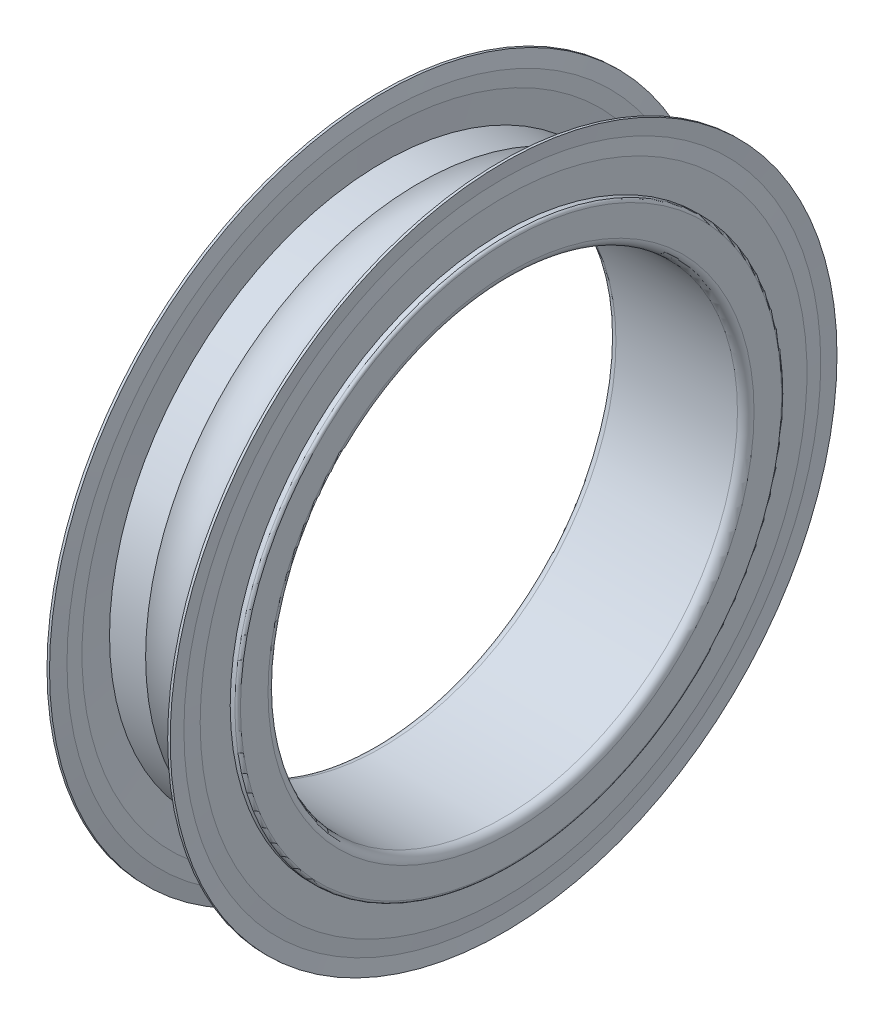
ISO-10303-21;
HEADER;
FILE_DESCRIPTION(('STEP AP214'),'2;1');
FILE_NAME('part.step','',(''),(''),'','','');
FILE_SCHEMA(('AUTOMOTIVE_DESIGN { 1 0 10303 214 1 1 1 1 }'));
ENDSEC;
DATA;
#1=APPLICATION_CONTEXT('core data for automotive mechanical design processes');
#2=APPLICATION_PROTOCOL_DEFINITION('international standard','automotive_design',2000,#1);
#3=PRODUCT_CONTEXT('',#1,'mechanical');
#4=PRODUCT('Part','Part','',(#3));
#5=PRODUCT_RELATED_PRODUCT_CATEGORY('part','',(#4));
#6=PRODUCT_DEFINITION_FORMATION('','',#4);
#7=PRODUCT_DEFINITION_CONTEXT('part definition',#1,'design');
#8=PRODUCT_DEFINITION('design','',#6,#7);
#9=PRODUCT_DEFINITION_SHAPE('','',#8);
#10=(LENGTH_UNIT() NAMED_UNIT(*) SI_UNIT(.MILLI.,.METRE.));
#11=(NAMED_UNIT(*) PLANE_ANGLE_UNIT() SI_UNIT($,.RADIAN.));
#12=(NAMED_UNIT(*) SI_UNIT($,.STERADIAN.) SOLID_ANGLE_UNIT());
#13=UNCERTAINTY_MEASURE_WITH_UNIT(LENGTH_MEASURE(1.E-05),#10,'distance_accuracy_value','');
#14=(GEOMETRIC_REPRESENTATION_CONTEXT(3) GLOBAL_UNCERTAINTY_ASSIGNED_CONTEXT((#13)) GLOBAL_UNIT_ASSIGNED_CONTEXT((#10,
#11,#12)) REPRESENTATION_CONTEXT('',''));
#15=CARTESIAN_POINT('',(0.,0.,0.));
#16=DIRECTION('',(0.,0.,1.));
#17=DIRECTION('',(1.,0.,0.));
#18=AXIS2_PLACEMENT_3D('',#15,#16,#17);
#19=CARTESIAN_POINT('',(2.5,0.,0.));
#20=DIRECTION('',(1.,0.,0.));
#21=DIRECTION('',(0.,0.,-1.));
#22=AXIS2_PLACEMENT_3D('',#19,#20,#21);
#23=TOROIDAL_SURFACE('',#22,10.75,1.1905);
#24=CARTESIAN_POINT('',(1.66645920915651,0.,0.));
#25=DIRECTION('',(-1.,0.,0.));
#26=DIRECTION('',(0.,0.,1.));
#27=AXIS2_PLACEMENT_3D('',#24,#25,#26);
#28=CIRCLE('',#27,9.9);
#29=CARTESIAN_POINT('',(1.66645920915651,0.,9.9));
#30=VERTEX_POINT('',#29);
#31=EDGE_CURVE('E190',#30,#30,#28,.T.);
#32=ORIENTED_EDGE('',*,*,#31,.F.);
#33=EDGE_LOOP('',(#32));
#34=FACE_BOUND('',#33,.T.);
#35=CARTESIAN_POINT('',(3.3335407908435,0.,0.));
#36=DIRECTION('',(-1.,0.,0.));
#37=DIRECTION('',(0.,0.,1.));
#38=AXIS2_PLACEMENT_3D('',#35,#36,#37);
#39=CIRCLE('',#38,9.9);
#40=CARTESIAN_POINT('',(3.3335407908435,0.,9.9));
#41=VERTEX_POINT('',#40);
#42=EDGE_CURVE('E195',#41,#41,#39,.F.);
#43=ORIENTED_EDGE('',*,*,#42,.F.);
#44=EDGE_LOOP('',(#43));
#45=FACE_BOUND('',#44,.T.);
#46=ADVANCED_FACE('F15',(#34,#45),#23,.F.);
#47=CARTESIAN_POINT('',(50.,0.,0.));
#48=DIRECTION('',(-1.,0.,0.));
#49=DIRECTION('',(0.,0.,1.));
#50=AXIS2_PLACEMENT_3D('',#47,#48,#49);
#51=CYLINDRICAL_SURFACE('',#50,9.9);
#52=CARTESIAN_POINT('',(4.64,0.,0.));
#53=DIRECTION('',(-1.,0.,0.));
#54=DIRECTION('',(0.,0.,1.));
#55=AXIS2_PLACEMENT_3D('',#52,#53,#54);
#56=CIRCLE('',#55,9.9);
#57=CARTESIAN_POINT('',(4.64,0.,9.9));
#58=VERTEX_POINT('',#57);
#59=EDGE_CURVE('E185',#58,#58,#56,.T.);
#60=ORIENTED_EDGE('',*,*,#59,.T.);
#61=EDGE_LOOP('',(#60));
#62=FACE_BOUND('',#61,.T.);
#63=ORIENTED_EDGE('',*,*,#42,.T.);
#64=EDGE_LOOP('',(#63));
#65=FACE_BOUND('',#64,.T.);
#66=ADVANCED_FACE('F235',(#62,#65),#51,.T.);
#67=CARTESIAN_POINT('',(50.,0.,0.));
#68=DIRECTION('',(-1.,0.,0.));
#69=DIRECTION('',(0.,0.,1.));
#70=AXIS2_PLACEMENT_3D('',#67,#68,#69);
#71=CYLINDRICAL_SURFACE('',#70,9.9);
#72=ORIENTED_EDGE('',*,*,#31,.T.);
#73=EDGE_LOOP('',(#72));
#74=FACE_BOUND('',#73,.T.);
#75=CARTESIAN_POINT('',(0.359999999999999,0.,0.));
#76=DIRECTION('',(1.,0.,0.));
#77=DIRECTION('',(0.,0.,-1.));
#78=AXIS2_PLACEMENT_3D('',#75,#76,#77);
#79=CIRCLE('',#78,9.9);
#80=CARTESIAN_POINT('',(0.359999999999999,0.,-9.9));
#81=VERTEX_POINT('',#80);
#82=EDGE_CURVE('E182',#81,#81,#79,.T.);
#83=ORIENTED_EDGE('',*,*,#82,.T.);
#84=EDGE_LOOP('',(#83));
#85=FACE_BOUND('',#84,.T.);
#86=ADVANCED_FACE('F231',(#74,#85),#71,.T.);
#87=CARTESIAN_POINT('',(4.55,0.,0.));
#88=DIRECTION('',(-1.,0.,0.));
#89=DIRECTION('',(0.,0.,1.));
#90=AXIS2_PLACEMENT_3D('',#87,#88,#89);
#91=CONICAL_SURFACE('',#90,10.9875,1.48822587110018);
#92=CARTESIAN_POINT('',(4.55,0.,0.));
#93=DIRECTION('',(-1.,0.,0.));
#94=DIRECTION('',(0.,0.,1.));
#95=AXIS2_PLACEMENT_3D('',#92,#93,#94);
#96=CIRCLE('',#95,10.9875);
#97=CARTESIAN_POINT('',(4.55,0.,10.9875));
#98=VERTEX_POINT('',#97);
#99=EDGE_CURVE('E19',#98,#98,#96,.F.);
#100=ORIENTED_EDGE('',*,*,#99,.F.);
#101=EDGE_LOOP('',(#100));
#102=FACE_BOUND('',#101,.T.);
#103=ORIENTED_EDGE('',*,*,#59,.F.);
#104=EDGE_LOOP('',(#103));
#105=FACE_BOUND('',#104,.T.);
#106=ADVANCED_FACE('F227',(#102,#105),#91,.F.);
#107=CARTESIAN_POINT('',(0.449999999999999,0.,0.));
#108=DIRECTION('',(1.,0.,0.));
#109=DIRECTION('',(0.,0.,-1.));
#110=AXIS2_PLACEMENT_3D('',#107,#108,#109);
#111=CONICAL_SURFACE('',#110,10.9875,1.48822587110018);
#112=ORIENTED_EDGE('',*,*,#82,.F.);
#113=EDGE_LOOP('',(#112));
#114=FACE_BOUND('',#113,.T.);
#115=CARTESIAN_POINT('',(0.449999999999999,0.,0.));
#116=DIRECTION('',(1.,0.,0.));
#117=DIRECTION('',(0.,0.,-1.));
#118=AXIS2_PLACEMENT_3D('',#115,#116,#117);
#119=CIRCLE('',#118,10.9875);
#120=CARTESIAN_POINT('',(0.449999999999999,0.,-10.9875));
#121=VERTEX_POINT('',#120);
#122=EDGE_CURVE('E218',#121,#121,#119,.F.);
#123=ORIENTED_EDGE('',*,*,#122,.F.);
#124=EDGE_LOOP('',(#123));
#125=FACE_BOUND('',#124,.T.);
#126=ADVANCED_FACE('F230',(#114,#125),#111,.F.);
#127=CARTESIAN_POINT('',(4.55,11.53125,0.));
#128=DIRECTION('',(-1.,0.,0.));
#129=DIRECTION('',(0.,0.,1.));
#130=AXIS2_PLACEMENT_3D('',#127,#128,#129);
#131=PLANE('',#130);
#132=CARTESIAN_POINT('',(4.55,0.,0.));
#133=DIRECTION('',(1.,0.,0.));
#134=DIRECTION('',(0.,0.,-1.));
#135=AXIS2_PLACEMENT_3D('',#132,#133,#134);
#136=CIRCLE('',#135,11.53125);
#137=CARTESIAN_POINT('',(4.55,0.,-11.53125));
#138=VERTEX_POINT('',#137);
#139=EDGE_CURVE('E216',#138,#138,#136,.T.);
#140=ORIENTED_EDGE('',*,*,#139,.F.);
#141=EDGE_LOOP('',(#140));
#142=FACE_BOUND('',#141,.T.);
#143=ORIENTED_EDGE('',*,*,#99,.T.);
#144=EDGE_LOOP('',(#143));
#145=FACE_BOUND('',#144,.T.);
#146=ADVANCED_FACE('F225',(#142,#145),#131,.T.);
#147=CARTESIAN_POINT('',(0.45,10.9875,0.));
#148=DIRECTION('',(1.,0.,0.));
#149=DIRECTION('',(0.,0.,-1.));
#150=AXIS2_PLACEMENT_3D('',#147,#148,#149);
#151=PLANE('',#150);
#152=ORIENTED_EDGE('',*,*,#122,.T.);
#153=EDGE_LOOP('',(#152));
#154=FACE_BOUND('',#153,.T.);
#155=CARTESIAN_POINT('',(0.449999999999999,0.,0.));
#156=DIRECTION('',(-1.,0.,0.));
#157=DIRECTION('',(0.,0.,1.));
#158=AXIS2_PLACEMENT_3D('',#155,#156,#157);
#159=CIRCLE('',#158,11.53125);
#160=CARTESIAN_POINT('',(0.449999999999999,0.,11.53125));
#161=VERTEX_POINT('',#160);
#162=EDGE_CURVE('E179',#161,#161,#159,.T.);
#163=ORIENTED_EDGE('',*,*,#162,.F.);
#164=EDGE_LOOP('',(#163));
#165=FACE_BOUND('',#164,.T.);
#166=ADVANCED_FACE('F386',(#154,#165),#151,.T.);
#167=CARTESIAN_POINT('',(4.64,0.,0.));
#168=DIRECTION('',(1.,0.,0.));
#169=DIRECTION('',(0.,0.,-1.));
#170=AXIS2_PLACEMENT_3D('',#167,#168,#169);
#171=CONICAL_SURFACE('',#170,12.075,1.40676621714642);
#172=CARTESIAN_POINT('',(4.64,0.,0.));
#173=DIRECTION('',(-1.,0.,0.));
#174=DIRECTION('',(0.,0.,1.));
#175=AXIS2_PLACEMENT_3D('',#172,#173,#174);
#176=CIRCLE('',#175,12.075);
#177=CARTESIAN_POINT('',(4.64,0.,12.075));
#178=VERTEX_POINT('',#177);
#179=EDGE_CURVE('E174',#178,#178,#176,.F.);
#180=ORIENTED_EDGE('',*,*,#179,.F.);
#181=EDGE_LOOP('',(#180));
#182=FACE_BOUND('',#181,.T.);
#183=ORIENTED_EDGE('',*,*,#139,.T.);
#184=EDGE_LOOP('',(#183));
#185=FACE_BOUND('',#184,.T.);
#186=ADVANCED_FACE('F378',(#182,#185),#171,.T.);
#187=CARTESIAN_POINT('',(0.360000000000001,0.,0.));
#188=DIRECTION('',(-1.,0.,0.));
#189=DIRECTION('',(0.,0.,1.));
#190=AXIS2_PLACEMENT_3D('',#187,#188,#189);
#191=CONICAL_SURFACE('',#190,12.075,1.40676621714642);
#192=ORIENTED_EDGE('',*,*,#162,.T.);
#193=EDGE_LOOP('',(#192));
#194=FACE_BOUND('',#193,.T.);
#195=CARTESIAN_POINT('',(0.359999999999999,0.,0.));
#196=DIRECTION('',(-1.,0.,0.));
#197=DIRECTION('',(0.,0.,1.));
#198=AXIS2_PLACEMENT_3D('',#195,#196,#197);
#199=CIRCLE('',#198,12.075);
#200=CARTESIAN_POINT('',(0.359999999999999,0.,12.075));
#201=VERTEX_POINT('',#200);
#202=EDGE_CURVE('E169',#201,#201,#199,.T.);
#203=ORIENTED_EDGE('',*,*,#202,.F.);
#204=EDGE_LOOP('',(#203));
#205=FACE_BOUND('',#204,.T.);
#206=ADVANCED_FACE('F370',(#194,#205),#191,.T.);
#207=CARTESIAN_POINT('',(50.,0.,0.));
#208=DIRECTION('',(-1.,0.,0.));
#209=DIRECTION('',(0.,0.,1.));
#210=AXIS2_PLACEMENT_3D('',#207,#208,#209);
#211=CYLINDRICAL_SURFACE('',#210,12.075);
#212=CARTESIAN_POINT('',(4.72999999999999,0.,0.));
#213=DIRECTION('',(1.,0.,0.));
#214=DIRECTION('',(0.,0.,-1.));
#215=AXIS2_PLACEMENT_3D('',#212,#213,#214);
#216=CIRCLE('',#215,12.075);
#217=CARTESIAN_POINT('',(4.72999999999999,0.,-12.075));
#218=VERTEX_POINT('',#217);
#219=EDGE_CURVE('E164',#218,#218,#216,.F.);
#220=ORIENTED_EDGE('',*,*,#219,.T.);
#221=EDGE_LOOP('',(#220));
#222=FACE_BOUND('',#221,.T.);
#223=ORIENTED_EDGE('',*,*,#179,.T.);
#224=EDGE_LOOP('',(#223));
#225=FACE_BOUND('',#224,.T.);
#226=ADVANCED_FACE('F362',(#222,#225),#211,.T.);
#227=CARTESIAN_POINT('',(50.,0.,0.));
#228=DIRECTION('',(-1.,0.,0.));
#229=DIRECTION('',(0.,0.,1.));
#230=AXIS2_PLACEMENT_3D('',#227,#228,#229);
#231=CYLINDRICAL_SURFACE('',#230,12.075);
#232=ORIENTED_EDGE('',*,*,#202,.T.);
#233=EDGE_LOOP('',(#232));
#234=FACE_BOUND('',#233,.T.);
#235=CARTESIAN_POINT('',(0.269999999999999,0.,0.));
#236=DIRECTION('',(-1.,0.,0.));
#237=DIRECTION('',(0.,0.,1.));
#238=AXIS2_PLACEMENT_3D('',#235,#236,#237);
#239=CIRCLE('',#238,12.075);
#240=CARTESIAN_POINT('',(0.269999999999999,0.,12.075));
#241=VERTEX_POINT('',#240);
#242=EDGE_CURVE('E159',#241,#241,#239,.F.);
#243=ORIENTED_EDGE('',*,*,#242,.T.);
#244=EDGE_LOOP('',(#243));
#245=FACE_BOUND('',#244,.T.);
#246=ADVANCED_FACE('F354',(#234,#245),#231,.T.);
#247=CARTESIAN_POINT('',(4.72999999999999,0.,0.));
#248=DIRECTION('',(1.,0.,0.));
#249=DIRECTION('',(0.,0.,-1.));
#250=AXIS2_PLACEMENT_3D('',#247,#248,#249);
#251=CONICAL_SURFACE('',#250,12.075,1.48822587110019);
#252=CARTESIAN_POINT('',(4.68500000000001,0.,0.));
#253=DIRECTION('',(-1.,0.,0.));
#254=DIRECTION('',(0.,0.,1.));
#255=AXIS2_PLACEMENT_3D('',#252,#253,#254);
#256=CIRCLE('',#255,11.53125);
#257=CARTESIAN_POINT('',(4.68500000000001,0.,11.53125));
#258=VERTEX_POINT('',#257);
#259=EDGE_CURVE('E154',#258,#258,#256,.F.);
#260=ORIENTED_EDGE('',*,*,#259,.F.);
#261=EDGE_LOOP('',(#260));
#262=FACE_BOUND('',#261,.T.);
#263=ORIENTED_EDGE('',*,*,#219,.F.);
#264=EDGE_LOOP('',(#263));
#265=FACE_BOUND('',#264,.T.);
#266=ADVANCED_FACE('F346',(#262,#265),#251,.F.);
#267=CARTESIAN_POINT('',(0.269999999999999,0.,0.));
#268=DIRECTION('',(-1.,0.,0.));
#269=DIRECTION('',(0.,0.,1.));
#270=AXIS2_PLACEMENT_3D('',#267,#268,#269);
#271=CONICAL_SURFACE('',#270,12.075,1.48822587110017);
#272=ORIENTED_EDGE('',*,*,#242,.F.);
#273=EDGE_LOOP('',(#272));
#274=FACE_BOUND('',#273,.T.);
#275=CARTESIAN_POINT('',(0.315000000000003,0.,0.));
#276=DIRECTION('',(1.,0.,0.));
#277=DIRECTION('',(0.,0.,-1.));
#278=AXIS2_PLACEMENT_3D('',#275,#276,#277);
#279=CIRCLE('',#278,11.53125);
#280=CARTESIAN_POINT('',(0.315000000000003,0.,-11.53125));
#281=VERTEX_POINT('',#280);
#282=EDGE_CURVE('E145',#281,#281,#279,.F.);
#283=ORIENTED_EDGE('',*,*,#282,.F.);
#284=EDGE_LOOP('',(#283));
#285=FACE_BOUND('',#284,.T.);
#286=ADVANCED_FACE('F338',(#274,#285),#271,.F.);
#287=CARTESIAN_POINT('',(4.68500000000001,0.,0.));
#288=DIRECTION('',(-1.,0.,0.));
#289=DIRECTION('',(0.,0.,1.));
#290=AXIS2_PLACEMENT_3D('',#287,#288,#289);
#291=CONICAL_SURFACE('',#290,11.53125,1.48822587110019);
#292=CARTESIAN_POINT('',(4.73,0.,0.));
#293=DIRECTION('',(-1.,0.,0.));
#294=DIRECTION('',(0.,0.,1.));
#295=AXIS2_PLACEMENT_3D('',#292,#293,#294);
#296=CIRCLE('',#295,10.9875);
#297=CARTESIAN_POINT('',(4.73,0.,10.9875));
#298=VERTEX_POINT('',#297);
#299=EDGE_CURVE('E153',#298,#298,#296,.F.);
#300=ORIENTED_EDGE('',*,*,#299,.F.);
#301=EDGE_LOOP('',(#300));
#302=FACE_BOUND('',#301,.T.);
#303=ORIENTED_EDGE('',*,*,#259,.T.);
#304=EDGE_LOOP('',(#303));
#305=FACE_BOUND('',#304,.T.);
#306=ADVANCED_FACE('F330',(#302,#305),#291,.T.);
#307=CARTESIAN_POINT('',(0.315000000000003,0.,0.));
#308=DIRECTION('',(1.,0.,0.));
#309=DIRECTION('',(0.,0.,-1.));
#310=AXIS2_PLACEMENT_3D('',#307,#308,#309);
#311=CONICAL_SURFACE('',#310,11.53125,1.48822587110017);
#312=ORIENTED_EDGE('',*,*,#282,.T.);
#313=EDGE_LOOP('',(#312));
#314=FACE_BOUND('',#313,.T.);
#315=CARTESIAN_POINT('',(0.269999999999998,0.,0.));
#316=DIRECTION('',(1.,0.,0.));
#317=DIRECTION('',(0.,0.,-1.));
#318=AXIS2_PLACEMENT_3D('',#315,#316,#317);
#319=CIRCLE('',#318,10.9875);
#320=CARTESIAN_POINT('',(0.269999999999998,0.,-10.9875));
#321=VERTEX_POINT('',#320);
#322=EDGE_CURVE('E209',#321,#321,#319,.F.);
#323=ORIENTED_EDGE('',*,*,#322,.F.);
#324=EDGE_LOOP('',(#323));
#325=FACE_BOUND('',#324,.T.);
#326=ADVANCED_FACE('F322',(#314,#325),#311,.T.);
#327=CARTESIAN_POINT('',(4.73,9.9,0.));
#328=DIRECTION('',(1.,0.,0.));
#329=DIRECTION('',(0.,0.,-1.));
#330=AXIS2_PLACEMENT_3D('',#327,#328,#329);
#331=PLANE('',#330);
#332=CARTESIAN_POINT('',(4.73,0.,0.));
#333=DIRECTION('',(-1.,0.,0.));
#334=DIRECTION('',(0.,0.,1.));
#335=AXIS2_PLACEMENT_3D('',#332,#333,#334);
#336=CIRCLE('',#335,9.9);
#337=CARTESIAN_POINT('',(4.73,0.,9.9));
#338=VERTEX_POINT('',#337);
#339=EDGE_CURVE('E206',#338,#338,#336,.F.);
#340=ORIENTED_EDGE('',*,*,#339,.F.);
#341=EDGE_LOOP('',(#340));
#342=FACE_BOUND('',#341,.T.);
#343=ORIENTED_EDGE('',*,*,#299,.T.);
#344=EDGE_LOOP('',(#343));
#345=FACE_BOUND('',#344,.T.);
#346=ADVANCED_FACE('F314',(#342,#345),#331,.T.);
#347=CARTESIAN_POINT('',(0.27,10.9875,0.));
#348=DIRECTION('',(-1.,0.,0.));
#349=DIRECTION('',(0.,0.,1.));
#350=AXIS2_PLACEMENT_3D('',#347,#348,#349);
#351=PLANE('',#350);
#352=ORIENTED_EDGE('',*,*,#322,.T.);
#353=EDGE_LOOP('',(#352));
#354=FACE_BOUND('',#353,.T.);
#355=CARTESIAN_POINT('',(0.269999999999999,0.,0.));
#356=DIRECTION('',(-1.,0.,0.));
#357=DIRECTION('',(0.,0.,1.));
#358=AXIS2_PLACEMENT_3D('',#355,#356,#357);
#359=CIRCLE('',#358,9.9);
#360=CARTESIAN_POINT('',(0.269999999999999,0.,9.9));
#361=VERTEX_POINT('',#360);
#362=EDGE_CURVE('E203',#361,#361,#359,.T.);
#363=ORIENTED_EDGE('',*,*,#362,.F.);
#364=EDGE_LOOP('',(#363));
#365=FACE_BOUND('',#364,.T.);
#366=ADVANCED_FACE('F307',(#354,#365),#351,.T.);
#367=CARTESIAN_POINT('',(50.,0.,0.));
#368=DIRECTION('',(-1.,0.,0.));
#369=DIRECTION('',(0.,0.,1.));
#370=AXIS2_PLACEMENT_3D('',#367,#368,#369);
#371=CYLINDRICAL_SURFACE('',#370,9.9);
#372=CARTESIAN_POINT('',(4.9,0.,0.));
#373=DIRECTION('',(1.,0.,0.));
#374=DIRECTION('',(0.,0.,-1.));
#375=AXIS2_PLACEMENT_3D('',#372,#373,#374);
#376=CIRCLE('',#375,9.9);
#377=CARTESIAN_POINT('',(4.9,0.,-9.9));
#378=VERTEX_POINT('',#377);
#379=EDGE_CURVE('E114',#378,#378,#376,.T.);
#380=ORIENTED_EDGE('',*,*,#379,.F.);
#381=EDGE_LOOP('',(#380));
#382=FACE_BOUND('',#381,.T.);
#383=ORIENTED_EDGE('',*,*,#339,.T.);
#384=EDGE_LOOP('',(#383));
#385=FACE_BOUND('',#384,.T.);
#386=ADVANCED_FACE('F300',(#382,#385),#371,.T.);
#387=CARTESIAN_POINT('',(50.,0.,0.));
#388=DIRECTION('',(-1.,0.,0.));
#389=DIRECTION('',(0.,0.,1.));
#390=AXIS2_PLACEMENT_3D('',#387,#388,#389);
#391=CYLINDRICAL_SURFACE('',#390,9.9);
#392=ORIENTED_EDGE('',*,*,#362,.T.);
#393=EDGE_LOOP('',(#392));
#394=FACE_BOUND('',#393,.T.);
#395=CARTESIAN_POINT('',(0.0999999999999975,0.,0.));
#396=DIRECTION('',(1.,0.,0.));
#397=DIRECTION('',(0.,0.,-1.));
#398=AXIS2_PLACEMENT_3D('',#395,#396,#397);
#399=CIRCLE('',#398,9.9);
#400=CARTESIAN_POINT('',(0.0999999999999975,0.,-9.9));
#401=VERTEX_POINT('',#400);
#402=EDGE_CURVE('E111',#401,#401,#399,.F.);
#403=ORIENTED_EDGE('',*,*,#402,.F.);
#404=EDGE_LOOP('',(#403));
#405=FACE_BOUND('',#404,.T.);
#406=ADVANCED_FACE('F137',(#394,#405),#391,.T.);
#407=CARTESIAN_POINT('',(4.9,0.,0.));
#408=DIRECTION('',(1.,0.,0.));
#409=DIRECTION('',(0.,0.,-1.));
#410=AXIS2_PLACEMENT_3D('',#407,#408,#409);
#411=TOROIDAL_SURFACE('',#410,9.8,0.0999999999999985);
#412=CARTESIAN_POINT('',(5.,0.,0.));
#413=DIRECTION('',(-1.,0.,0.));
#414=DIRECTION('',(0.,0.,-1.));
#415=AXIS2_PLACEMENT_3D('',#412,#413,#414);
#416=CIRCLE('',#415,9.8);
#417=CARTESIAN_POINT('',(5.,0.,-9.8));
#418=VERTEX_POINT('',#417);
#419=EDGE_CURVE('E66',#418,#418,#416,.F.);
#420=ORIENTED_EDGE('',*,*,#419,.F.);
#421=EDGE_LOOP('',(#420));
#422=FACE_BOUND('',#421,.T.);
#423=ORIENTED_EDGE('',*,*,#379,.T.);
#424=EDGE_LOOP('',(#423));
#425=FACE_BOUND('',#424,.T.);
#426=ADVANCED_FACE('F133',(#422,#425),#411,.T.);
#427=CARTESIAN_POINT('',(0.0999999999999975,0.,0.));
#428=DIRECTION('',(1.,0.,0.));
#429=DIRECTION('',(0.,0.,-1.));
#430=AXIS2_PLACEMENT_3D('',#427,#428,#429);
#431=TOROIDAL_SURFACE('',#430,9.8,0.0999999999999959);
#432=ORIENTED_EDGE('',*,*,#402,.T.);
#433=EDGE_LOOP('',(#432));
#434=FACE_BOUND('',#433,.T.);
#435=CARTESIAN_POINT('',(0.,0.,0.));
#436=DIRECTION('',(1.,0.,0.));
#437=DIRECTION('',(0.,0.,-1.));
#438=AXIS2_PLACEMENT_3D('',#435,#436,#437);
#439=CIRCLE('',#438,9.8);
#440=CARTESIAN_POINT('',(0.,0.,-9.8));
#441=VERTEX_POINT('',#440);
#442=EDGE_CURVE('E121',#441,#441,#439,.F.);
#443=ORIENTED_EDGE('',*,*,#442,.F.);
#444=EDGE_LOOP('',(#443));
#445=FACE_BOUND('',#444,.T.);
#446=ADVANCED_FACE('F83',(#434,#445),#431,.T.);
#447=CARTESIAN_POINT('',(5.,8.8,0.));
#448=DIRECTION('',(1.,0.,0.));
#449=DIRECTION('',(0.,0.,-1.));
#450=AXIS2_PLACEMENT_3D('',#447,#448,#449);
#451=PLANE('',#450);
#452=CARTESIAN_POINT('',(5.,0.,0.));
#453=DIRECTION('',(1.,0.,0.));
#454=DIRECTION('',(0.,0.,-1.));
#455=AXIS2_PLACEMENT_3D('',#452,#453,#454);
#456=CIRCLE('',#455,8.8);
#457=CARTESIAN_POINT('',(5.,0.,-8.8));
#458=VERTEX_POINT('',#457);
#459=EDGE_CURVE('E101',#458,#458,#456,.T.);
#460=ORIENTED_EDGE('',*,*,#459,.F.);
#461=EDGE_LOOP('',(#460));
#462=FACE_BOUND('',#461,.T.);
#463=ORIENTED_EDGE('',*,*,#419,.T.);
#464=EDGE_LOOP('',(#463));
#465=FACE_BOUND('',#464,.T.);
#466=ADVANCED_FACE('F73',(#462,#465),#451,.T.);
#467=CARTESIAN_POINT('',(0.,9.8,0.));
#468=DIRECTION('',(-1.,0.,0.));
#469=DIRECTION('',(0.,0.,1.));
#470=AXIS2_PLACEMENT_3D('',#467,#468,#469);
#471=PLANE('',#470);
#472=ORIENTED_EDGE('',*,*,#442,.T.);
#473=EDGE_LOOP('',(#472));
#474=FACE_BOUND('',#473,.T.);
#475=CARTESIAN_POINT('',(0.,0.,0.));
#476=DIRECTION('',(-1.,0.,0.));
#477=DIRECTION('',(0.,0.,-1.));
#478=AXIS2_PLACEMENT_3D('',#475,#476,#477);
#479=CIRCLE('',#478,8.8);
#480=CARTESIAN_POINT('',(0.,0.,-8.8));
#481=VERTEX_POINT('',#480);
#482=EDGE_CURVE('E28',#481,#481,#479,.T.);
#483=ORIENTED_EDGE('',*,*,#482,.F.);
#484=EDGE_LOOP('',(#483));
#485=FACE_BOUND('',#484,.T.);
#486=ADVANCED_FACE('F82',(#474,#485),#471,.T.);
#487=CARTESIAN_POINT('',(4.7,0.,0.));
#488=DIRECTION('',(1.,0.,0.));
#489=DIRECTION('',(0.,0.,-1.));
#490=AXIS2_PLACEMENT_3D('',#487,#488,#489);
#491=TOROIDAL_SURFACE('',#490,8.8,0.300000000000002);
#492=CARTESIAN_POINT('',(4.7,0.,0.));
#493=DIRECTION('',(-1.,0.,0.));
#494=DIRECTION('',(0.,0.,1.));
#495=AXIS2_PLACEMENT_3D('',#492,#493,#494);
#496=CIRCLE('',#495,8.5);
#497=CARTESIAN_POINT('',(4.7,0.,8.5));
#498=VERTEX_POINT('',#497);
#499=EDGE_CURVE('E23',#498,#498,#496,.T.);
#500=ORIENTED_EDGE('',*,*,#499,.T.);
#501=EDGE_LOOP('',(#500));
#502=FACE_BOUND('',#501,.T.);
#503=ORIENTED_EDGE('',*,*,#459,.T.);
#504=EDGE_LOOP('',(#503));
#505=FACE_BOUND('',#504,.T.);
#506=ADVANCED_FACE('F46',(#502,#505),#491,.T.);
#507=CARTESIAN_POINT('',(0.300000000000002,0.,0.));
#508=DIRECTION('',(1.,0.,0.));
#509=DIRECTION('',(0.,0.,-1.));
#510=AXIS2_PLACEMENT_3D('',#507,#508,#509);
#511=TOROIDAL_SURFACE('',#510,8.8,0.300000000000002);
#512=ORIENTED_EDGE('',*,*,#482,.T.);
#513=EDGE_LOOP('',(#512));
#514=FACE_BOUND('',#513,.T.);
#515=CARTESIAN_POINT('',(0.300000000000002,0.,0.));
#516=DIRECTION('',(-1.,0.,0.));
#517=DIRECTION('',(0.,0.,1.));
#518=AXIS2_PLACEMENT_3D('',#515,#516,#517);
#519=CIRCLE('',#518,8.5);
#520=CARTESIAN_POINT('',(0.300000000000002,0.,8.5));
#521=VERTEX_POINT('',#520);
#522=EDGE_CURVE('E10',#521,#521,#519,.F.);
#523=ORIENTED_EDGE('',*,*,#522,.T.);
#524=EDGE_LOOP('',(#523));
#525=FACE_BOUND('',#524,.T.);
#526=ADVANCED_FACE('F40',(#514,#525),#511,.T.);
#527=CARTESIAN_POINT('',(50.,0.,0.));
#528=DIRECTION('',(-1.,0.,0.));
#529=DIRECTION('',(0.,0.,1.));
#530=AXIS2_PLACEMENT_3D('',#527,#528,#529);
#531=CYLINDRICAL_SURFACE('',#530,8.5);
#532=ORIENTED_EDGE('',*,*,#522,.F.);
#533=EDGE_LOOP('',(#532));
#534=FACE_BOUND('',#533,.T.);
#535=ORIENTED_EDGE('',*,*,#499,.F.);
#536=EDGE_LOOP('',(#535));
#537=FACE_BOUND('',#536,.T.);
#538=ADVANCED_FACE('F45',(#534,#537),#531,.F.);
#539=CLOSED_SHELL('',(#46,#66,#86,#106,#126,#146,#166,#186,#206,#226,#246,#266,#286,#306,#326,
#346,#366,#386,#406,#426,#446,#466,#486,#506,#526,#538));
#540=MANIFOLD_SOLID_BREP('B1',#539);
#541=ADVANCED_BREP_SHAPE_REPRESENTATION('',(#18,#540),#14);
#542=SHAPE_DEFINITION_REPRESENTATION(#9,#541);
ENDSEC;
END-ISO-10303-21;
